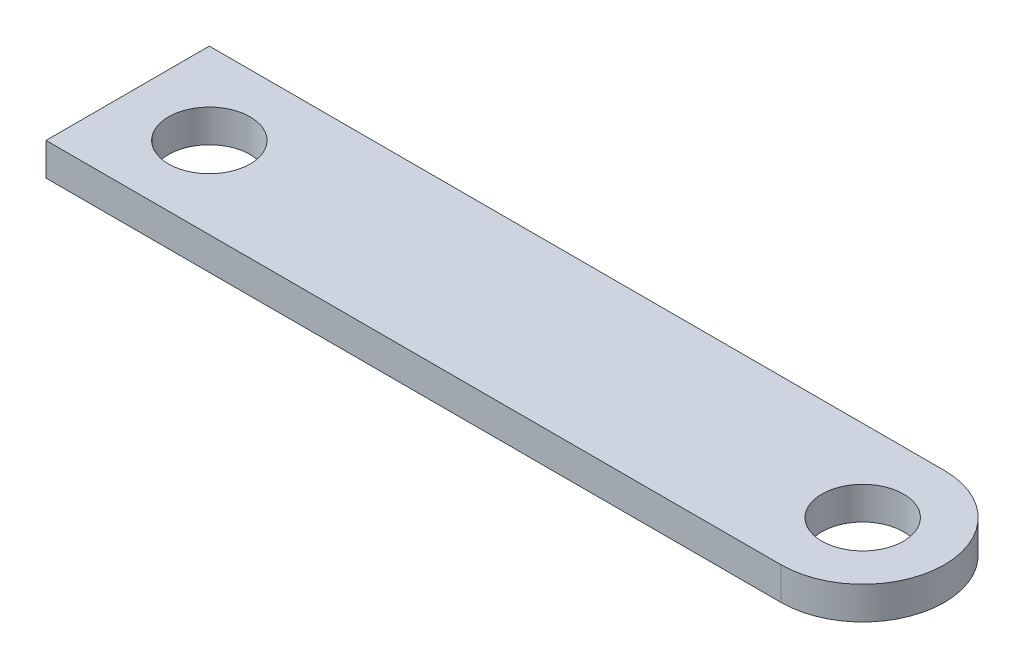
ISO-10303-21;
HEADER;
FILE_DESCRIPTION(('STEP AP214'),'2;1');
FILE_NAME('part.step','',(''),(''),'','','');
FILE_SCHEMA(('AUTOMOTIVE_DESIGN { 1 0 10303 214 1 1 1 1 }'));
ENDSEC;
DATA;
#1=APPLICATION_CONTEXT('core data for automotive mechanical design processes');
#2=APPLICATION_PROTOCOL_DEFINITION('international standard','automotive_design',2000,#1);
#3=PRODUCT_CONTEXT('',#1,'mechanical');
#4=PRODUCT('Part','Part','',(#3));
#5=PRODUCT_RELATED_PRODUCT_CATEGORY('part','',(#4));
#6=PRODUCT_DEFINITION_FORMATION('','',#4);
#7=PRODUCT_DEFINITION_CONTEXT('part definition',#1,'design');
#8=PRODUCT_DEFINITION('design','',#6,#7);
#9=PRODUCT_DEFINITION_SHAPE('','',#8);
#10=(LENGTH_UNIT() NAMED_UNIT(*) SI_UNIT(.MILLI.,.METRE.));
#11=(NAMED_UNIT(*) PLANE_ANGLE_UNIT() SI_UNIT($,.RADIAN.));
#12=(NAMED_UNIT(*) SI_UNIT($,.STERADIAN.) SOLID_ANGLE_UNIT());
#13=UNCERTAINTY_MEASURE_WITH_UNIT(LENGTH_MEASURE(1.E-05),#10,'distance_accuracy_value','');
#14=(GEOMETRIC_REPRESENTATION_CONTEXT(3) GLOBAL_UNCERTAINTY_ASSIGNED_CONTEXT((#13)) GLOBAL_UNIT_ASSIGNED_CONTEXT((#10,
#11,#12)) REPRESENTATION_CONTEXT('',''));
#15=CARTESIAN_POINT('',(0.,0.,0.));
#16=DIRECTION('',(0.,0.,1.));
#17=DIRECTION('',(1.,0.,0.));
#18=AXIS2_PLACEMENT_3D('',#15,#16,#17);
#19=CARTESIAN_POINT('',(22.5,2.,0.));
#20=DIRECTION('',(0.,-1.,0.));
#21=DIRECTION('',(0.,0.,-1.));
#22=AXIS2_PLACEMENT_3D('',#19,#20,#21);
#23=CYLINDRICAL_SURFACE('',#22,5.);
#24=DIRECTION('',(0.,-1.,0.));
#25=VECTOR('',#24,1.);
#26=CARTESIAN_POINT('',(22.5,2.,-5.));
#27=LINE('',#26,#25);
#28=CARTESIAN_POINT('',(22.5,2.,-5.));
#29=VERTEX_POINT('',#28);
#30=CARTESIAN_POINT('',(22.5,0.,-5.));
#31=VERTEX_POINT('',#30);
#32=EDGE_CURVE('E93',#29,#31,#27,.T.);
#33=ORIENTED_EDGE('',*,*,#32,.F.);
#34=CARTESIAN_POINT('',(22.5,2.,0.));
#35=DIRECTION('',(0.,1.,0.));
#36=DIRECTION('',(0.,0.,1.));
#37=AXIS2_PLACEMENT_3D('',#34,#35,#36);
#38=CIRCLE('',#37,5.);
#39=CARTESIAN_POINT('',(22.5,2.,5.));
#40=VERTEX_POINT('',#39);
#41=EDGE_CURVE('E12',#40,#29,#38,.T.);
#42=ORIENTED_EDGE('',*,*,#41,.F.);
#43=DIRECTION('',(0.,-1.,0.));
#44=VECTOR('',#43,1.);
#45=CARTESIAN_POINT('',(22.5,2.,5.));
#46=LINE('',#45,#44);
#47=CARTESIAN_POINT('',(22.5,0.,5.));
#48=VERTEX_POINT('',#47);
#49=EDGE_CURVE('E114',#40,#48,#46,.T.);
#50=ORIENTED_EDGE('',*,*,#49,.T.);
#51=CARTESIAN_POINT('',(22.5,0.,0.));
#52=DIRECTION('',(0.,1.,0.));
#53=DIRECTION('',(0.,0.,1.));
#54=AXIS2_PLACEMENT_3D('',#51,#52,#53);
#55=CIRCLE('',#54,5.);
#56=EDGE_CURVE('E79',#48,#31,#55,.T.);
#57=ORIENTED_EDGE('',*,*,#56,.T.);
#58=EDGE_LOOP('',(#33,#42,#50,#57));
#59=FACE_BOUND('',#58,.T.);
#60=ADVANCED_FACE('F75',(#59),#23,.T.);
#61=CARTESIAN_POINT('',(22.5,2.,0.));
#62=DIRECTION('',(0.,-1.,0.));
#63=DIRECTION('',(0.,0.,-1.));
#64=AXIS2_PLACEMENT_3D('',#61,#62,#63);
#65=CYLINDRICAL_SURFACE('',#64,2.5);
#66=CARTESIAN_POINT('',(22.5,0.,0.));
#67=DIRECTION('',(0.,1.,0.));
#68=DIRECTION('',(0.,0.,1.));
#69=AXIS2_PLACEMENT_3D('',#66,#67,#68);
#70=CIRCLE('',#69,2.5);
#71=CARTESIAN_POINT('',(22.5,0.,2.5));
#72=VERTEX_POINT('',#71);
#73=EDGE_CURVE('E166',#72,#72,#70,.T.);
#74=ORIENTED_EDGE('',*,*,#73,.F.);
#75=EDGE_LOOP('',(#74));
#76=FACE_BOUND('',#75,.T.);
#77=CARTESIAN_POINT('',(22.5,2.,0.));
#78=DIRECTION('',(0.,1.,0.));
#79=DIRECTION('',(0.,0.,1.));
#80=AXIS2_PLACEMENT_3D('',#77,#78,#79);
#81=CIRCLE('',#80,2.5);
#82=CARTESIAN_POINT('',(22.5,2.,2.5));
#83=VERTEX_POINT('',#82);
#84=EDGE_CURVE('E85',#83,#83,#81,.T.);
#85=ORIENTED_EDGE('',*,*,#84,.T.);
#86=EDGE_LOOP('',(#85));
#87=FACE_BOUND('',#86,.T.);
#88=ADVANCED_FACE('F77',(#76,#87),#65,.F.);
#89=CARTESIAN_POINT('',(0.,2.,0.));
#90=DIRECTION('',(0.,1.,0.));
#91=DIRECTION('',(0.,0.,1.));
#92=AXIS2_PLACEMENT_3D('',#89,#90,#91);
#93=PLANE('',#92);
#94=ORIENTED_EDGE('',*,*,#84,.F.);
#95=EDGE_LOOP('',(#94));
#96=FACE_BOUND('',#95,.T.);
#97=DIRECTION('',(1.,0.,0.));
#98=VECTOR('',#97,1.);
#99=CARTESIAN_POINT('',(0.,2.,5.));
#100=LINE('',#99,#98);
#101=CARTESIAN_POINT('',(-22.5,2.,5.));
#102=VERTEX_POINT('',#101);
#103=EDGE_CURVE('E120',#102,#40,#100,.T.);
#104=ORIENTED_EDGE('',*,*,#103,.T.);
#105=ORIENTED_EDGE('',*,*,#41,.T.);
#106=DIRECTION('',(1.,0.,0.));
#107=VECTOR('',#106,1.);
#108=CARTESIAN_POINT('',(0.,2.,-5.));
#109=LINE('',#108,#107);
#110=CARTESIAN_POINT('',(-22.5,2.,-5.));
#111=VERTEX_POINT('',#110);
#112=EDGE_CURVE('E145',#111,#29,#109,.T.);
#113=ORIENTED_EDGE('',*,*,#112,.F.);
#114=DIRECTION('',(0.,0.,-1.));
#115=VECTOR('',#114,1.);
#116=CARTESIAN_POINT('',(-22.5,2.,0.));
#117=LINE('',#116,#115);
#118=EDGE_CURVE('E124',#102,#111,#117,.T.);
#119=ORIENTED_EDGE('',*,*,#118,.F.);
#120=EDGE_LOOP('',(#104,#105,#113,#119));
#121=FACE_BOUND('',#120,.T.);
#122=CARTESIAN_POINT('',(-17.5,2.,0.));
#123=DIRECTION('',(0.,1.,0.));
#124=DIRECTION('',(0.,0.,1.));
#125=AXIS2_PLACEMENT_3D('',#122,#123,#124);
#126=CIRCLE('',#125,2.5);
#127=CARTESIAN_POINT('',(-17.5,2.,2.5));
#128=VERTEX_POINT('',#127);
#129=EDGE_CURVE('E141',#128,#128,#126,.T.);
#130=ORIENTED_EDGE('',*,*,#129,.F.);
#131=EDGE_LOOP('',(#130));
#132=FACE_BOUND('',#131,.T.);
#133=ADVANCED_FACE('F121',(#96,#121,#132),#93,.T.);
#134=CARTESIAN_POINT('',(0.,0.,0.));
#135=DIRECTION('',(0.,1.,0.));
#136=DIRECTION('',(0.,0.,1.));
#137=AXIS2_PLACEMENT_3D('',#134,#135,#136);
#138=PLANE('',#137);
#139=ORIENTED_EDGE('',*,*,#73,.T.);
#140=EDGE_LOOP('',(#139));
#141=FACE_BOUND('',#140,.T.);
#142=ORIENTED_EDGE('',*,*,#56,.F.);
#143=DIRECTION('',(1.,0.,0.));
#144=VECTOR('',#143,1.);
#145=CARTESIAN_POINT('',(0.,0.,5.));
#146=LINE('',#145,#144);
#147=CARTESIAN_POINT('',(-22.5,0.,5.));
#148=VERTEX_POINT('',#147);
#149=EDGE_CURVE('E129',#148,#48,#146,.T.);
#150=ORIENTED_EDGE('',*,*,#149,.F.);
#151=DIRECTION('',(0.,0.,-1.));
#152=VECTOR('',#151,1.);
#153=CARTESIAN_POINT('',(-22.5,0.,0.));
#154=LINE('',#153,#152);
#155=CARTESIAN_POINT('',(-22.5,0.,-5.));
#156=VERTEX_POINT('',#155);
#157=EDGE_CURVE('E146',#148,#156,#154,.T.);
#158=ORIENTED_EDGE('',*,*,#157,.T.);
#159=DIRECTION('',(1.,0.,0.));
#160=VECTOR('',#159,1.);
#161=CARTESIAN_POINT('',(0.,0.,-5.));
#162=LINE('',#161,#160);
#163=EDGE_CURVE('E155',#156,#31,#162,.T.);
#164=ORIENTED_EDGE('',*,*,#163,.T.);
#165=EDGE_LOOP('',(#142,#150,#158,#164));
#166=FACE_BOUND('',#165,.T.);
#167=CARTESIAN_POINT('',(-17.5,0.,0.));
#168=DIRECTION('',(0.,1.,0.));
#169=DIRECTION('',(0.,0.,1.));
#170=AXIS2_PLACEMENT_3D('',#167,#168,#169);
#171=CIRCLE('',#170,2.5);
#172=CARTESIAN_POINT('',(-17.5,0.,2.5));
#173=VERTEX_POINT('',#172);
#174=EDGE_CURVE('E137',#173,#173,#171,.T.);
#175=ORIENTED_EDGE('',*,*,#174,.T.);
#176=EDGE_LOOP('',(#175));
#177=FACE_BOUND('',#176,.T.);
#178=ADVANCED_FACE('F174',(#141,#166,#177),#138,.F.);
#179=CARTESIAN_POINT('',(-17.5,2.,0.));
#180=DIRECTION('',(0.,-1.,0.));
#181=DIRECTION('',(0.,0.,-1.));
#182=AXIS2_PLACEMENT_3D('',#179,#180,#181);
#183=CYLINDRICAL_SURFACE('',#182,2.5);
#184=ORIENTED_EDGE('',*,*,#174,.F.);
#185=EDGE_LOOP('',(#184));
#186=FACE_BOUND('',#185,.T.);
#187=ORIENTED_EDGE('',*,*,#129,.T.);
#188=EDGE_LOOP('',(#187));
#189=FACE_BOUND('',#188,.T.);
#190=ADVANCED_FACE('F186',(#186,#189),#183,.F.);
#191=CARTESIAN_POINT('',(0.,2.,-5.));
#192=DIRECTION('',(0.,0.,-1.));
#193=DIRECTION('',(-1.,0.,0.));
#194=AXIS2_PLACEMENT_3D('',#191,#192,#193);
#195=PLANE('',#194);
#196=ORIENTED_EDGE('',*,*,#163,.F.);
#197=DIRECTION('',(0.,-1.,0.));
#198=VECTOR('',#197,1.);
#199=CARTESIAN_POINT('',(-22.5,2.,-5.));
#200=LINE('',#199,#198);
#201=EDGE_CURVE('E151',#111,#156,#200,.T.);
#202=ORIENTED_EDGE('',*,*,#201,.F.);
#203=ORIENTED_EDGE('',*,*,#112,.T.);
#204=ORIENTED_EDGE('',*,*,#32,.T.);
#205=EDGE_LOOP('',(#196,#202,#203,#204));
#206=FACE_BOUND('',#205,.T.);
#207=ADVANCED_FACE('F220',(#206),#195,.T.);
#208=CARTESIAN_POINT('',(-22.5,2.,0.));
#209=DIRECTION('',(-1.,0.,0.));
#210=DIRECTION('',(0.,0.,1.));
#211=AXIS2_PLACEMENT_3D('',#208,#209,#210);
#212=PLANE('',#211);
#213=ORIENTED_EDGE('',*,*,#157,.F.);
#214=DIRECTION('',(0.,-1.,0.));
#215=VECTOR('',#214,1.);
#216=CARTESIAN_POINT('',(-22.5,2.,5.));
#217=LINE('',#216,#215);
#218=EDGE_CURVE('E134',#102,#148,#217,.T.);
#219=ORIENTED_EDGE('',*,*,#218,.F.);
#220=ORIENTED_EDGE('',*,*,#118,.T.);
#221=ORIENTED_EDGE('',*,*,#201,.T.);
#222=EDGE_LOOP('',(#213,#219,#220,#221));
#223=FACE_BOUND('',#222,.T.);
#224=ADVANCED_FACE('F230',(#223),#212,.T.);
#225=CARTESIAN_POINT('',(0.,2.,5.));
#226=DIRECTION('',(0.,0.,-1.));
#227=DIRECTION('',(-1.,0.,0.));
#228=AXIS2_PLACEMENT_3D('',#225,#226,#227);
#229=PLANE('',#228);
#230=ORIENTED_EDGE('',*,*,#149,.T.);
#231=ORIENTED_EDGE('',*,*,#49,.F.);
#232=ORIENTED_EDGE('',*,*,#103,.F.);
#233=ORIENTED_EDGE('',*,*,#218,.T.);
#234=EDGE_LOOP('',(#230,#231,#232,#233));
#235=FACE_BOUND('',#234,.T.);
#236=ADVANCED_FACE('F131',(#235),#229,.F.);
#237=CLOSED_SHELL('',(#60,#88,#133,#178,#190,#207,#224,#236));
#238=MANIFOLD_SOLID_BREP('B2',#237);
#239=ADVANCED_BREP_SHAPE_REPRESENTATION('',(#18,#238),#14);
#240=SHAPE_DEFINITION_REPRESENTATION(#9,#239);
ENDSEC;
END-ISO-10303-21;
